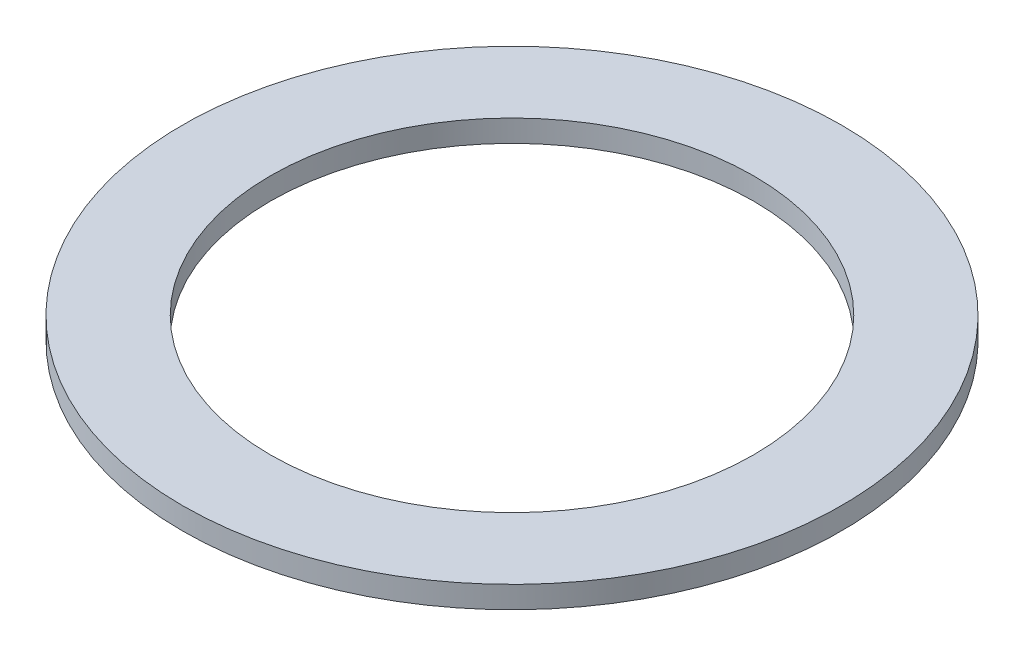
ISO-10303-21;
HEADER;
FILE_DESCRIPTION(('STEP AP214'),'2;1');
FILE_NAME('part.step','',(''),(''),'','','');
FILE_SCHEMA(('AUTOMOTIVE_DESIGN { 1 0 10303 214 1 1 1 1 }'));
ENDSEC;
DATA;
#1=APPLICATION_CONTEXT('core data for automotive mechanical design processes');
#2=APPLICATION_PROTOCOL_DEFINITION('international standard','automotive_design',2000,#1);
#3=PRODUCT_CONTEXT('',#1,'mechanical');
#4=PRODUCT('Part','Part','',(#3));
#5=PRODUCT_RELATED_PRODUCT_CATEGORY('part','',(#4));
#6=PRODUCT_DEFINITION_FORMATION('','',#4);
#7=PRODUCT_DEFINITION_CONTEXT('part definition',#1,'design');
#8=PRODUCT_DEFINITION('design','',#6,#7);
#9=PRODUCT_DEFINITION_SHAPE('','',#8);
#10=(LENGTH_UNIT() NAMED_UNIT(*) SI_UNIT(.MILLI.,.METRE.));
#11=(NAMED_UNIT(*) PLANE_ANGLE_UNIT() SI_UNIT($,.RADIAN.));
#12=(NAMED_UNIT(*) SI_UNIT($,.STERADIAN.) SOLID_ANGLE_UNIT());
#13=UNCERTAINTY_MEASURE_WITH_UNIT(LENGTH_MEASURE(1.E-05),#10,'distance_accuracy_value','');
#14=(GEOMETRIC_REPRESENTATION_CONTEXT(3) GLOBAL_UNCERTAINTY_ASSIGNED_CONTEXT((#13)) GLOBAL_UNIT_ASSIGNED_CONTEXT((#10,
#11,#12)) REPRESENTATION_CONTEXT('',''));
#15=CARTESIAN_POINT('',(0.,0.,0.));
#16=DIRECTION('',(0.,0.,1.));
#17=DIRECTION('',(1.,0.,0.));
#18=AXIS2_PLACEMENT_3D('',#15,#16,#17);
#19=CARTESIAN_POINT('',(-169.493181637917,2.54,-146.319449111959));
#20=DIRECTION('',(0.,1.,0.));
#21=DIRECTION('',(0.,0.,1.));
#22=AXIS2_PLACEMENT_3D('',#19,#20,#21);
#23=PLANE('',#22);
#24=CARTESIAN_POINT('',(-169.493181637917,2.54,-146.319449111959));
#25=DIRECTION('',(0.,1.,0.));
#26=DIRECTION('',(0.,0.,1.));
#27=AXIS2_PLACEMENT_3D('',#24,#25,#26);
#28=CIRCLE('',#27,38.1);
#29=CARTESIAN_POINT('',(-169.493181637917,2.54,-108.219449111959));
#30=VERTEX_POINT('',#29);
#31=EDGE_CURVE('E10',#30,#30,#28,.T.);
#32=ORIENTED_EDGE('',*,*,#31,.T.);
#33=EDGE_LOOP('',(#32));
#34=FACE_BOUND('',#33,.T.);
#35=CARTESIAN_POINT('',(-169.493181637917,2.54,-146.319449111959));
#36=DIRECTION('',(0.,1.,0.));
#37=DIRECTION('',(0.,0.,1.));
#38=AXIS2_PLACEMENT_3D('',#35,#36,#37);
#39=CIRCLE('',#38,27.94);
#40=CARTESIAN_POINT('',(-169.493181637917,2.54,-118.379449111959));
#41=VERTEX_POINT('',#40);
#42=EDGE_CURVE('E42',#41,#41,#39,.T.);
#43=ORIENTED_EDGE('',*,*,#42,.F.);
#44=EDGE_LOOP('',(#43));
#45=FACE_BOUND('',#44,.T.);
#46=ADVANCED_FACE('F31',(#34,#45),#23,.T.);
#47=CARTESIAN_POINT('',(-169.493181637917,0.,-146.319449111959));
#48=DIRECTION('',(0.,1.,0.));
#49=DIRECTION('',(0.,0.,1.));
#50=AXIS2_PLACEMENT_3D('',#47,#48,#49);
#51=PLANE('',#50);
#52=CARTESIAN_POINT('',(-169.493181637917,0.,-146.319449111959));
#53=DIRECTION('',(0.,1.,0.));
#54=DIRECTION('',(0.,0.,1.));
#55=AXIS2_PLACEMENT_3D('',#52,#53,#54);
#56=CIRCLE('',#55,38.1);
#57=CARTESIAN_POINT('',(-169.493181637917,0.,-108.219449111959));
#58=VERTEX_POINT('',#57);
#59=EDGE_CURVE('E35',#58,#58,#56,.T.);
#60=ORIENTED_EDGE('',*,*,#59,.F.);
#61=EDGE_LOOP('',(#60));
#62=FACE_BOUND('',#61,.T.);
#63=CARTESIAN_POINT('',(-169.493181637917,0.,-146.319449111959));
#64=DIRECTION('',(0.,1.,0.));
#65=DIRECTION('',(0.,0.,1.));
#66=AXIS2_PLACEMENT_3D('',#63,#64,#65);
#67=CIRCLE('',#66,27.94);
#68=CARTESIAN_POINT('',(-169.493181637917,0.,-118.379449111959));
#69=VERTEX_POINT('',#68);
#70=EDGE_CURVE('E44',#69,#69,#67,.T.);
#71=ORIENTED_EDGE('',*,*,#70,.T.);
#72=EDGE_LOOP('',(#71));
#73=FACE_BOUND('',#72,.T.);
#74=ADVANCED_FACE('F54',(#62,#73),#51,.F.);
#75=CARTESIAN_POINT('',(-169.493181637917,2.54,-146.319449111959));
#76=DIRECTION('',(0.,-1.,0.));
#77=DIRECTION('',(0.,0.,-1.));
#78=AXIS2_PLACEMENT_3D('',#75,#76,#77);
#79=CYLINDRICAL_SURFACE('',#78,38.1);
#80=ORIENTED_EDGE('',*,*,#31,.F.);
#81=EDGE_LOOP('',(#80));
#82=FACE_BOUND('',#81,.T.);
#83=ORIENTED_EDGE('',*,*,#59,.T.);
#84=EDGE_LOOP('',(#83));
#85=FACE_BOUND('',#84,.T.);
#86=ADVANCED_FACE('F33',(#82,#85),#79,.T.);
#87=CARTESIAN_POINT('',(-169.493181637917,2.54,-146.319449111959));
#88=DIRECTION('',(0.,-1.,0.));
#89=DIRECTION('',(0.,0.,-1.));
#90=AXIS2_PLACEMENT_3D('',#87,#88,#89);
#91=CYLINDRICAL_SURFACE('',#90,27.94);
#92=ORIENTED_EDGE('',*,*,#42,.T.);
#93=EDGE_LOOP('',(#92));
#94=FACE_BOUND('',#93,.T.);
#95=ORIENTED_EDGE('',*,*,#70,.F.);
#96=EDGE_LOOP('',(#95));
#97=FACE_BOUND('',#96,.T.);
#98=ADVANCED_FACE('F50',(#94,#97),#91,.F.);
#99=CLOSED_SHELL('',(#46,#74,#86,#98));
#100=MANIFOLD_SOLID_BREP('B2',#99);
#101=ADVANCED_BREP_SHAPE_REPRESENTATION('',(#18,#100),#14);
#102=SHAPE_DEFINITION_REPRESENTATION(#9,#101);
ENDSEC;
END-ISO-10303-21;
